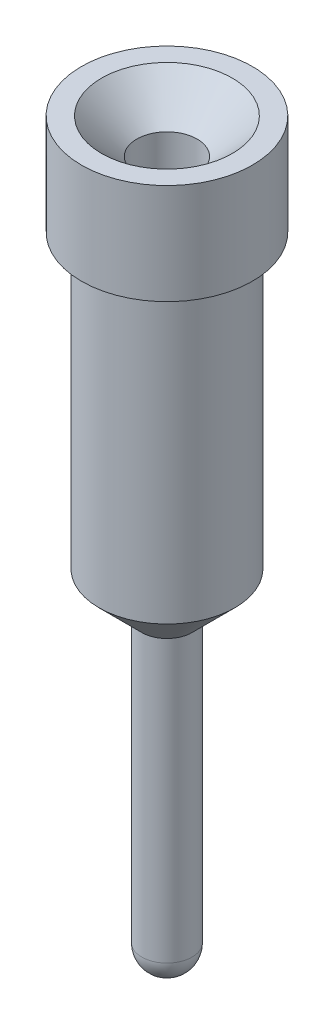
ISO-10303-21;
HEADER;
FILE_DESCRIPTION(('STEP AP214'),'2;1');
FILE_NAME('part.step','',(''),(''),'','','');
FILE_SCHEMA(('AUTOMOTIVE_DESIGN { 1 0 10303 214 1 1 1 1 }'));
ENDSEC;
DATA;
#1=APPLICATION_CONTEXT('core data for automotive mechanical design processes');
#2=APPLICATION_PROTOCOL_DEFINITION('international standard','automotive_design',2000,#1);
#3=PRODUCT_CONTEXT('',#1,'mechanical');
#4=PRODUCT('Part','Part','',(#3));
#5=PRODUCT_RELATED_PRODUCT_CATEGORY('part','',(#4));
#6=PRODUCT_DEFINITION_FORMATION('','',#4);
#7=PRODUCT_DEFINITION_CONTEXT('part definition',#1,'design');
#8=PRODUCT_DEFINITION('design','',#6,#7);
#9=PRODUCT_DEFINITION_SHAPE('','',#8);
#10=(LENGTH_UNIT() NAMED_UNIT(*) SI_UNIT(.MILLI.,.METRE.));
#11=(NAMED_UNIT(*) PLANE_ANGLE_UNIT() SI_UNIT($,.RADIAN.));
#12=(NAMED_UNIT(*) SI_UNIT($,.STERADIAN.) SOLID_ANGLE_UNIT());
#13=UNCERTAINTY_MEASURE_WITH_UNIT(LENGTH_MEASURE(1.E-05),#10,'distance_accuracy_value','');
#14=(GEOMETRIC_REPRESENTATION_CONTEXT(3) GLOBAL_UNCERTAINTY_ASSIGNED_CONTEXT((#13)) GLOBAL_UNIT_ASSIGNED_CONTEXT((#10,
#11,#12)) REPRESENTATION_CONTEXT('',''));
#15=CARTESIAN_POINT('',(0.,0.,0.));
#16=DIRECTION('',(0.,0.,1.));
#17=DIRECTION('',(1.,0.,0.));
#18=AXIS2_PLACEMENT_3D('',#15,#16,#17);
#19=CARTESIAN_POINT('',(-0.849999999999997,0.,0.));
#20=DIRECTION('',(0.,1.,0.));
#21=DIRECTION('',(0.,0.,1.));
#22=AXIS2_PLACEMENT_3D('',#19,#20,#21);
#23=PLANE('',#22);
#24=CARTESIAN_POINT('',(0.,0.,0.));
#25=DIRECTION('',(0.,1.,0.));
#26=DIRECTION('',(0.,0.,1.));
#27=AXIS2_PLACEMENT_3D('',#24,#25,#26);
#28=CIRCLE('',#27,0.849999999999997);
#29=CARTESIAN_POINT('',(0.,0.,0.849999999999997));
#30=VERTEX_POINT('',#29);
#31=EDGE_CURVE('E11',#30,#30,#28,.T.);
#32=ORIENTED_EDGE('',*,*,#31,.T.);
#33=EDGE_LOOP('',(#32));
#34=FACE_BOUND('',#33,.T.);
#35=CARTESIAN_POINT('',(0.,0.,0.));
#36=DIRECTION('',(0.,1.,0.));
#37=DIRECTION('',(0.,0.,1.));
#38=AXIS2_PLACEMENT_3D('',#35,#36,#37);
#39=CIRCLE('',#38,0.649999999999995);
#40=CARTESIAN_POINT('',(0.,0.,0.649999999999995));
#41=VERTEX_POINT('',#40);
#42=EDGE_CURVE('E74',#41,#41,#39,.T.);
#43=ORIENTED_EDGE('',*,*,#42,.F.);
#44=EDGE_LOOP('',(#43));
#45=FACE_BOUND('',#44,.T.);
#46=ADVANCED_FACE('F36',(#34,#45),#23,.T.);
#47=CARTESIAN_POINT('',(0.,28.992562867327,0.));
#48=DIRECTION('',(0.,1.,0.));
#49=DIRECTION('',(0.,0.,1.));
#50=AXIS2_PLACEMENT_3D('',#47,#48,#49);
#51=CYLINDRICAL_SURFACE('',#50,0.849999999999996);
#52=CARTESIAN_POINT('',(0.,-1.,0.));
#53=DIRECTION('',(0.,1.,0.));
#54=DIRECTION('',(0.,0.,1.));
#55=AXIS2_PLACEMENT_3D('',#52,#53,#54);
#56=CIRCLE('',#55,0.849999999999996);
#57=CARTESIAN_POINT('',(0.,-1.,0.849999999999996));
#58=VERTEX_POINT('',#57);
#59=EDGE_CURVE('E42',#58,#58,#56,.T.);
#60=ORIENTED_EDGE('',*,*,#59,.T.);
#61=EDGE_LOOP('',(#60));
#62=FACE_BOUND('',#61,.T.);
#63=ORIENTED_EDGE('',*,*,#31,.F.);
#64=EDGE_LOOP('',(#63));
#65=FACE_BOUND('',#64,.T.);
#66=ADVANCED_FACE('F63',(#62,#65),#51,.T.);
#67=CARTESIAN_POINT('',(-0.849999999999996,-0.999999999999999,0.));
#68=DIRECTION('',(0.,-1.,0.));
#69=DIRECTION('',(0.,0.,-1.));
#70=AXIS2_PLACEMENT_3D('',#67,#68,#69);
#71=PLANE('',#70);
#72=CARTESIAN_POINT('',(0.,-1.,0.));
#73=DIRECTION('',(0.,1.,0.));
#74=DIRECTION('',(0.,0.,1.));
#75=AXIS2_PLACEMENT_3D('',#72,#73,#74);
#76=CIRCLE('',#75,0.674999999999996);
#77=CARTESIAN_POINT('',(0.,-1.,0.674999999999996));
#78=VERTEX_POINT('',#77);
#79=EDGE_CURVE('E92',#78,#78,#76,.T.);
#80=ORIENTED_EDGE('',*,*,#79,.T.);
#81=EDGE_LOOP('',(#80));
#82=FACE_BOUND('',#81,.T.);
#83=ORIENTED_EDGE('',*,*,#59,.F.);
#84=EDGE_LOOP('',(#83));
#85=FACE_BOUND('',#84,.T.);
#86=ADVANCED_FACE('F68',(#82,#85),#71,.T.);
#87=CARTESIAN_POINT('',(0.,28.992562867327,0.));
#88=DIRECTION('',(0.,1.,0.));
#89=DIRECTION('',(0.,0.,1.));
#90=AXIS2_PLACEMENT_3D('',#87,#88,#89);
#91=CYLINDRICAL_SURFACE('',#90,0.674999999999996);
#92=CARTESIAN_POINT('',(0.,-3.9,0.));
#93=DIRECTION('',(0.,1.,0.));
#94=DIRECTION('',(0.,0.,1.));
#95=AXIS2_PLACEMENT_3D('',#92,#93,#94);
#96=CIRCLE('',#95,0.674999999999995);
#97=CARTESIAN_POINT('',(0.,-3.9,0.674999999999995));
#98=VERTEX_POINT('',#97);
#99=EDGE_CURVE('E89',#98,#98,#96,.T.);
#100=ORIENTED_EDGE('',*,*,#99,.T.);
#101=EDGE_LOOP('',(#100));
#102=FACE_BOUND('',#101,.T.);
#103=ORIENTED_EDGE('',*,*,#79,.F.);
#104=EDGE_LOOP('',(#103));
#105=FACE_BOUND('',#104,.T.);
#106=ADVANCED_FACE('F99',(#102,#105),#91,.T.);
#107=CARTESIAN_POINT('',(0.,-3.9,0.));
#108=DIRECTION('',(0.,1.,0.));
#109=DIRECTION('',(0.,0.,1.));
#110=AXIS2_PLACEMENT_3D('',#107,#108,#109);
#111=CONICAL_SURFACE('',#110,0.674999999999995,0.785398163397453);
#112=CARTESIAN_POINT('',(0.,-4.325,0.));
#113=DIRECTION('',(0.,1.,0.));
#114=DIRECTION('',(0.,0.,1.));
#115=AXIS2_PLACEMENT_3D('',#112,#113,#114);
#116=CIRCLE('',#115,0.249999999999996);
#117=CARTESIAN_POINT('',(0.,-4.325,0.249999999999996));
#118=VERTEX_POINT('',#117);
#119=EDGE_CURVE('E86',#118,#118,#116,.T.);
#120=ORIENTED_EDGE('',*,*,#119,.T.);
#121=EDGE_LOOP('',(#120));
#122=FACE_BOUND('',#121,.T.);
#123=ORIENTED_EDGE('',*,*,#99,.F.);
#124=EDGE_LOOP('',(#123));
#125=FACE_BOUND('',#124,.T.);
#126=ADVANCED_FACE('F105',(#122,#125),#111,.T.);
#127=CARTESIAN_POINT('',(0.,28.992562867327,0.));
#128=DIRECTION('',(0.,1.,0.));
#129=DIRECTION('',(0.,0.,1.));
#130=AXIS2_PLACEMENT_3D('',#127,#128,#129);
#131=CYLINDRICAL_SURFACE('',#130,0.249999999999996);
#132=CARTESIAN_POINT('',(0.,-7.12,0.));
#133=DIRECTION('',(0.,1.,0.));
#134=DIRECTION('',(0.,0.,1.));
#135=AXIS2_PLACEMENT_3D('',#132,#133,#134);
#136=CIRCLE('',#135,0.249999999999996);
#137=CARTESIAN_POINT('',(0.,-7.12,0.249999999999996));
#138=VERTEX_POINT('',#137);
#139=EDGE_CURVE('E83',#138,#138,#136,.T.);
#140=ORIENTED_EDGE('',*,*,#139,.T.);
#141=EDGE_LOOP('',(#140));
#142=FACE_BOUND('',#141,.T.);
#143=ORIENTED_EDGE('',*,*,#119,.F.);
#144=EDGE_LOOP('',(#143));
#145=FACE_BOUND('',#144,.T.);
#146=ADVANCED_FACE('F58',(#142,#145),#131,.T.);
#147=CARTESIAN_POINT('',(0.,-7.12,0.));
#148=DIRECTION('',(0.,1.,0.));
#149=DIRECTION('',(-1.,0.,0.));
#150=AXIS2_PLACEMENT_3D('',#147,#148,#149);
#151=SPHERICAL_SURFACE('',#150,0.249999999999996);
#152=ORIENTED_EDGE('',*,*,#139,.F.);
#153=EDGE_LOOP('',(#152));
#154=FACE_BOUND('',#153,.T.);
#155=ADVANCED_FACE('F48',(#154),#151,.T.);
#156=CARTESIAN_POINT('',(0.,-4.,0.));
#157=DIRECTION('',(0.,1.,0.));
#158=DIRECTION('',(0.,0.,1.));
#159=AXIS2_PLACEMENT_3D('',#156,#157,#158);
#160=CONICAL_SURFACE('',#159,0.,0.785398163397442);
#161=CARTESIAN_POINT('',(0.,-3.7,0.));
#162=DIRECTION('',(0.,1.,0.));
#163=DIRECTION('',(0.,0.,1.));
#164=AXIS2_PLACEMENT_3D('',#161,#162,#163);
#165=CIRCLE('',#164,0.299999999999995);
#166=CARTESIAN_POINT('',(0.,-3.7,0.299999999999995));
#167=VERTEX_POINT('',#166);
#168=EDGE_CURVE('E79',#167,#167,#165,.T.);
#169=ORIENTED_EDGE('',*,*,#168,.T.);
#170=EDGE_LOOP('',(#169));
#171=FACE_BOUND('',#170,.T.);
#172=CARTESIAN_POINT('',(0.,-4.,0.));
#173=VERTEX_POINT('',#172);
#174=VERTEX_LOOP('',#173);
#175=FACE_BOUND('',#174,.T.);
#176=ADVANCED_FACE('F45',(#171,#175),#160,.F.);
#177=CARTESIAN_POINT('',(0.,28.992562867327,0.));
#178=DIRECTION('',(0.,1.,0.));
#179=DIRECTION('',(0.,0.,1.));
#180=AXIS2_PLACEMENT_3D('',#177,#178,#179);
#181=CYLINDRICAL_SURFACE('',#180,0.299999999999996);
#182=CARTESIAN_POINT('',(0.,-0.35,0.));
#183=DIRECTION('',(0.,1.,0.));
#184=DIRECTION('',(0.,0.,1.));
#185=AXIS2_PLACEMENT_3D('',#182,#183,#184);
#186=CIRCLE('',#185,0.299999999999996);
#187=CARTESIAN_POINT('',(0.,-0.35,0.299999999999996));
#188=VERTEX_POINT('',#187);
#189=EDGE_CURVE('E76',#188,#188,#186,.T.);
#190=ORIENTED_EDGE('',*,*,#189,.T.);
#191=EDGE_LOOP('',(#190));
#192=FACE_BOUND('',#191,.T.);
#193=ORIENTED_EDGE('',*,*,#168,.F.);
#194=EDGE_LOOP('',(#193));
#195=FACE_BOUND('',#194,.T.);
#196=ADVANCED_FACE('F47',(#192,#195),#181,.F.);
#197=CARTESIAN_POINT('',(0.,-0.35,0.));
#198=DIRECTION('',(0.,1.,0.));
#199=DIRECTION('',(0.,0.,1.));
#200=AXIS2_PLACEMENT_3D('',#197,#198,#199);
#201=CONICAL_SURFACE('',#200,0.299999999999996,0.785398163397447);
#202=ORIENTED_EDGE('',*,*,#42,.T.);
#203=EDGE_LOOP('',(#202));
#204=FACE_BOUND('',#203,.T.);
#205=ORIENTED_EDGE('',*,*,#189,.F.);
#206=EDGE_LOOP('',(#205));
#207=FACE_BOUND('',#206,.T.);
#208=ADVANCED_FACE('F55',(#204,#207),#201,.F.);
#209=CLOSED_SHELL('',(#46,#66,#86,#106,#126,#146,#155,#176,#196,#208));
#210=MANIFOLD_SOLID_BREP('B2',#209);
#211=ADVANCED_BREP_SHAPE_REPRESENTATION('',(#18,#210),#14);
#212=SHAPE_DEFINITION_REPRESENTATION(#9,#211);
ENDSEC;
END-ISO-10303-21;
